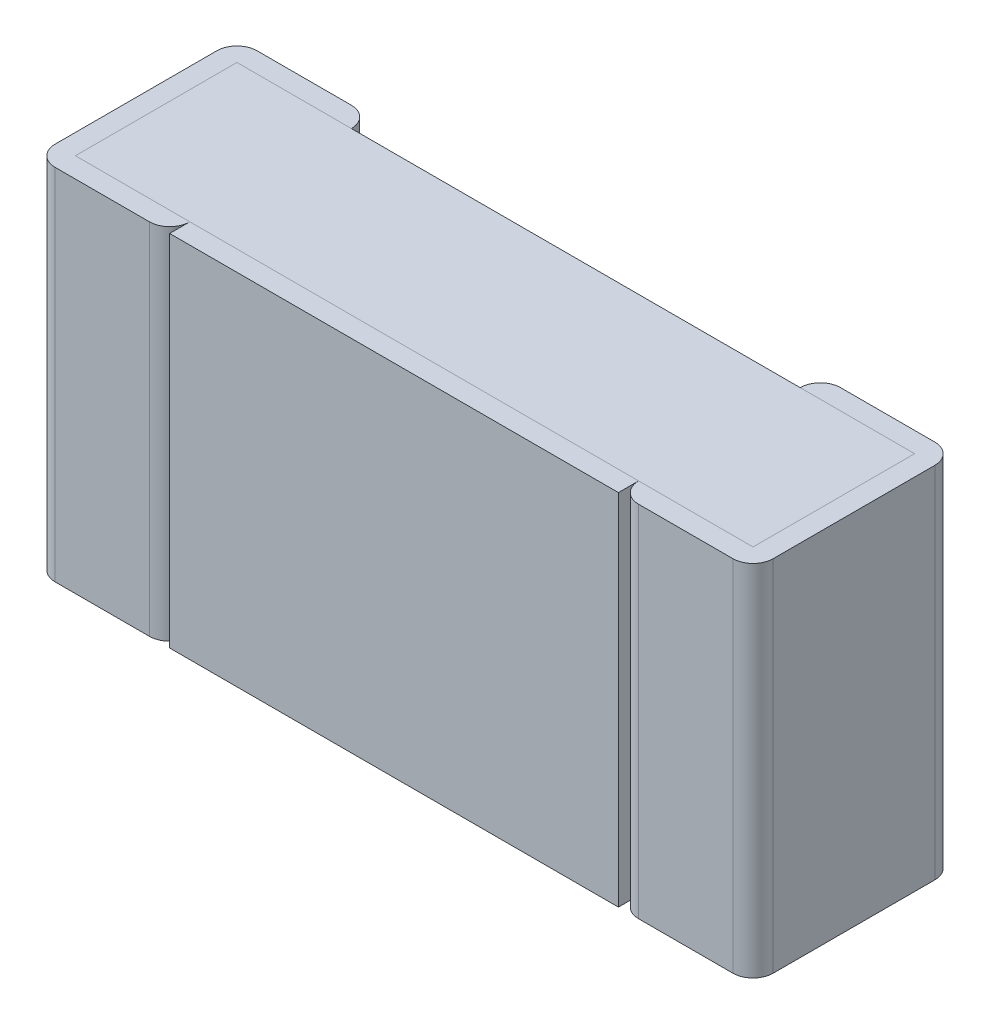
ISO-10303-21;
HEADER;
FILE_DESCRIPTION(('STEP AP214'),'2;1');
FILE_NAME('part.step','',(''),(''),'','','');
FILE_SCHEMA(('AUTOMOTIVE_DESIGN { 1 0 10303 214 1 1 1 1 }'));
ENDSEC;
DATA;
#1=APPLICATION_CONTEXT('core data for automotive mechanical design processes');
#2=APPLICATION_PROTOCOL_DEFINITION('international standard','automotive_design',2000,#1);
#3=PRODUCT_CONTEXT('',#1,'mechanical');
#4=PRODUCT('Part','Part','',(#3));
#5=PRODUCT_RELATED_PRODUCT_CATEGORY('part','',(#4));
#6=PRODUCT_DEFINITION_FORMATION('','',#4);
#7=PRODUCT_DEFINITION_CONTEXT('part definition',#1,'design');
#8=PRODUCT_DEFINITION('design','',#6,#7);
#9=PRODUCT_DEFINITION_SHAPE('','',#8);
#10=(LENGTH_UNIT() NAMED_UNIT(*) SI_UNIT(.MILLI.,.METRE.));
#11=(NAMED_UNIT(*) PLANE_ANGLE_UNIT() SI_UNIT($,.RADIAN.));
#12=(NAMED_UNIT(*) SI_UNIT($,.STERADIAN.) SOLID_ANGLE_UNIT());
#13=UNCERTAINTY_MEASURE_WITH_UNIT(LENGTH_MEASURE(1.E-05),#10,'distance_accuracy_value','');
#14=(GEOMETRIC_REPRESENTATION_CONTEXT(3) GLOBAL_UNCERTAINTY_ASSIGNED_CONTEXT((#13)) GLOBAL_UNIT_ASSIGNED_CONTEXT((#10,
#11,#12)) REPRESENTATION_CONTEXT('',''));
#15=CARTESIAN_POINT('',(0.,0.,0.));
#16=DIRECTION('',(0.,0.,1.));
#17=DIRECTION('',(1.,0.,0.));
#18=AXIS2_PLACEMENT_3D('',#15,#16,#17);
#19=CARTESIAN_POINT('',(-0.5,-0.4,0.45));
#20=DIRECTION('',(0.,0.,1.));
#21=DIRECTION('',(1.,0.,0.));
#22=AXIS2_PLACEMENT_3D('',#19,#20,#21);
#23=PLANE('',#22);
#24=DIRECTION('',(0.,1.,0.));
#25=VECTOR('',#24,1.);
#26=CARTESIAN_POINT('',(-0.5,-0.4,0.45));
#27=LINE('',#26,#25);
#28=CARTESIAN_POINT('',(-0.5,-0.4,0.45));
#29=VERTEX_POINT('',#28);
#30=CARTESIAN_POINT('',(-0.5,0.4,0.45));
#31=VERTEX_POINT('',#30);
#32=EDGE_CURVE('E144',#29,#31,#27,.T.);
#33=ORIENTED_EDGE('',*,*,#32,.F.);
#34=DIRECTION('',(1.,0.,0.));
#35=VECTOR('',#34,1.);
#36=CARTESIAN_POINT('',(-0.5,-0.4,0.45));
#37=LINE('',#36,#35);
#38=CARTESIAN_POINT('',(0.5,-0.4,0.45));
#39=VERTEX_POINT('',#38);
#40=EDGE_CURVE('E138',#29,#39,#37,.T.);
#41=ORIENTED_EDGE('',*,*,#40,.T.);
#42=DIRECTION('',(0.,1.,0.));
#43=VECTOR('',#42,1.);
#44=CARTESIAN_POINT('',(0.5,-0.4,0.45));
#45=LINE('',#44,#43);
#46=CARTESIAN_POINT('',(0.5,0.4,0.45));
#47=VERTEX_POINT('',#46);
#48=EDGE_CURVE('E11',#39,#47,#45,.T.);
#49=ORIENTED_EDGE('',*,*,#48,.T.);
#50=DIRECTION('',(1.,0.,0.));
#51=VECTOR('',#50,1.);
#52=CARTESIAN_POINT('',(-0.5,0.4,0.45));
#53=LINE('',#52,#51);
#54=EDGE_CURVE('E111',#31,#47,#53,.T.);
#55=ORIENTED_EDGE('',*,*,#54,.F.);
#56=EDGE_LOOP('',(#33,#41,#49,#55));
#57=FACE_BOUND('',#56,.T.);
#58=ADVANCED_FACE('F18',(#57),#23,.T.);
#59=CARTESIAN_POINT('',(0.5,-0.4,0.405));
#60=DIRECTION('',(1.,0.,0.));
#61=DIRECTION('',(0.,1.,0.));
#62=AXIS2_PLACEMENT_3D('',#59,#60,#61);
#63=PLANE('',#62);
#64=DIRECTION('',(0.,0.,1.));
#65=VECTOR('',#64,1.);
#66=CARTESIAN_POINT('',(0.5,-0.4,0.405));
#67=LINE('',#66,#65);
#68=CARTESIAN_POINT('',(0.5,-0.4,0.405));
#69=VERTEX_POINT('',#68);
#70=EDGE_CURVE('E136',#69,#39,#67,.T.);
#71=ORIENTED_EDGE('',*,*,#70,.F.);
#72=DIRECTION('',(0.,1.,0.));
#73=VECTOR('',#72,1.);
#74=CARTESIAN_POINT('',(0.5,-0.4,0.405));
#75=LINE('',#74,#73);
#76=CARTESIAN_POINT('',(0.5,0.4,0.405));
#77=VERTEX_POINT('',#76);
#78=EDGE_CURVE('E26',#69,#77,#75,.T.);
#79=ORIENTED_EDGE('',*,*,#78,.T.);
#80=DIRECTION('',(0.,0.,1.));
#81=VECTOR('',#80,1.);
#82=CARTESIAN_POINT('',(0.5,0.4,0.405));
#83=LINE('',#82,#81);
#84=EDGE_CURVE('E112',#77,#47,#83,.T.);
#85=ORIENTED_EDGE('',*,*,#84,.T.);
#86=ORIENTED_EDGE('',*,*,#48,.F.);
#87=EDGE_LOOP('',(#71,#79,#85,#86));
#88=FACE_BOUND('',#87,.T.);
#89=ADVANCED_FACE('F267',(#88),#63,.T.);
#90=CARTESIAN_POINT('',(0.545,-0.4,0.405));
#91=DIRECTION('',(0.,1.,0.));
#92=DIRECTION('',(-1.,0.,0.));
#93=AXIS2_PLACEMENT_3D('',#90,#91,#92);
#94=CYLINDRICAL_SURFACE('',#93,0.045);
#95=CARTESIAN_POINT('',(0.545,-0.4,0.405));
#96=DIRECTION('',(0.,1.,0.));
#97=DIRECTION('',(0.,0.,1.));
#98=AXIS2_PLACEMENT_3D('',#95,#96,#97);
#99=CIRCLE('',#98,0.045);
#100=CARTESIAN_POINT('',(0.545,-0.4,0.45));
#101=VERTEX_POINT('',#100);
#102=EDGE_CURVE('E245',#69,#101,#99,.T.);
#103=ORIENTED_EDGE('',*,*,#102,.T.);
#104=DIRECTION('',(0.,1.,0.));
#105=VECTOR('',#104,1.);
#106=CARTESIAN_POINT('',(0.545,-0.4,0.45));
#107=LINE('',#106,#105);
#108=CARTESIAN_POINT('',(0.545,0.4,0.45));
#109=VERTEX_POINT('',#108);
#110=EDGE_CURVE('E81',#101,#109,#107,.T.);
#111=ORIENTED_EDGE('',*,*,#110,.T.);
#112=CARTESIAN_POINT('',(0.545,0.4,0.405));
#113=DIRECTION('',(0.,1.,0.));
#114=DIRECTION('',(0.,0.,1.));
#115=AXIS2_PLACEMENT_3D('',#112,#113,#114);
#116=CIRCLE('',#115,0.045);
#117=EDGE_CURVE('E97',#77,#109,#116,.T.);
#118=ORIENTED_EDGE('',*,*,#117,.F.);
#119=ORIENTED_EDGE('',*,*,#78,.F.);
#120=EDGE_LOOP('',(#103,#111,#118,#119));
#121=FACE_BOUND('',#120,.T.);
#122=ADVANCED_FACE('F584',(#121),#94,.T.);
#123=CARTESIAN_POINT('',(0.5,-0.4,0.45));
#124=DIRECTION('',(0.,0.,1.));
#125=DIRECTION('',(1.,0.,0.));
#126=AXIS2_PLACEMENT_3D('',#123,#124,#125);
#127=PLANE('',#126);
#128=DIRECTION('',(1.,0.,0.));
#129=VECTOR('',#128,1.);
#130=CARTESIAN_POINT('',(0.5,0.4,0.45));
#131=LINE('',#130,#129);
#132=CARTESIAN_POINT('',(0.755,0.4,0.45));
#133=VERTEX_POINT('',#132);
#134=EDGE_CURVE('E72',#109,#133,#131,.T.);
#135=ORIENTED_EDGE('',*,*,#134,.F.);
#136=ORIENTED_EDGE('',*,*,#110,.F.);
#137=DIRECTION('',(1.,0.,0.));
#138=VECTOR('',#137,1.);
#139=CARTESIAN_POINT('',(0.5,-0.4,0.45));
#140=LINE('',#139,#138);
#141=CARTESIAN_POINT('',(0.755,-0.4,0.45));
#142=VERTEX_POINT('',#141);
#143=EDGE_CURVE('E76',#101,#142,#140,.T.);
#144=ORIENTED_EDGE('',*,*,#143,.T.);
#145=DIRECTION('',(0.,1.,0.));
#146=VECTOR('',#145,1.);
#147=CARTESIAN_POINT('',(0.755,-0.4,0.45));
#148=LINE('',#147,#146);
#149=EDGE_CURVE('E67',#142,#133,#148,.T.);
#150=ORIENTED_EDGE('',*,*,#149,.T.);
#151=EDGE_LOOP('',(#135,#136,#144,#150));
#152=FACE_BOUND('',#151,.T.);
#153=ADVANCED_FACE('F69',(#152),#127,.T.);
#154=CARTESIAN_POINT('',(0.755,-0.4,0.405));
#155=DIRECTION('',(0.,1.,0.));
#156=DIRECTION('',(1.,0.,0.));
#157=AXIS2_PLACEMENT_3D('',#154,#155,#156);
#158=CYLINDRICAL_SURFACE('',#157,0.045);
#159=DIRECTION('',(0.,1.,0.));
#160=VECTOR('',#159,1.);
#161=CARTESIAN_POINT('',(0.8,-0.4,0.405));
#162=LINE('',#161,#160);
#163=CARTESIAN_POINT('',(0.8,-0.4,0.405));
#164=VERTEX_POINT('',#163);
#165=CARTESIAN_POINT('',(0.8,0.4,0.405));
#166=VERTEX_POINT('',#165);
#167=EDGE_CURVE('E82',#164,#166,#162,.T.);
#168=ORIENTED_EDGE('',*,*,#167,.T.);
#169=CARTESIAN_POINT('',(0.755,0.4,0.405));
#170=DIRECTION('',(0.,-1.,0.));
#171=DIRECTION('',(0.,0.,1.));
#172=AXIS2_PLACEMENT_3D('',#169,#170,#171);
#173=CIRCLE('',#172,0.045);
#174=EDGE_CURVE('E85',#166,#133,#173,.T.);
#175=ORIENTED_EDGE('',*,*,#174,.T.);
#176=ORIENTED_EDGE('',*,*,#149,.F.);
#177=CARTESIAN_POINT('',(0.755,-0.4,0.405));
#178=DIRECTION('',(0.,-1.,0.));
#179=DIRECTION('',(0.,0.,1.));
#180=AXIS2_PLACEMENT_3D('',#177,#178,#179);
#181=CIRCLE('',#180,0.045);
#182=EDGE_CURVE('E237',#164,#142,#181,.T.);
#183=ORIENTED_EDGE('',*,*,#182,.F.);
#184=EDGE_LOOP('',(#168,#175,#176,#183));
#185=FACE_BOUND('',#184,.T.);
#186=ADVANCED_FACE('F86',(#185),#158,.T.);
#187=CARTESIAN_POINT('',(0.8,-0.4,0.));
#188=DIRECTION('',(1.,0.,0.));
#189=DIRECTION('',(0.,1.,0.));
#190=AXIS2_PLACEMENT_3D('',#187,#188,#189);
#191=PLANE('',#190);
#192=DIRECTION('',(0.,0.,1.));
#193=VECTOR('',#192,1.);
#194=CARTESIAN_POINT('',(0.8,-0.4,0.));
#195=LINE('',#194,#193);
#196=CARTESIAN_POINT('',(0.8,-0.4,0.045));
#197=VERTEX_POINT('',#196);
#198=EDGE_CURVE('E233',#197,#164,#195,.T.);
#199=ORIENTED_EDGE('',*,*,#198,.F.);
#200=DIRECTION('',(0.,1.,0.));
#201=VECTOR('',#200,1.);
#202=CARTESIAN_POINT('',(0.8,-0.4,0.045));
#203=LINE('',#202,#201);
#204=CARTESIAN_POINT('',(0.8,0.4,0.045));
#205=VERTEX_POINT('',#204);
#206=EDGE_CURVE('E49',#197,#205,#203,.T.);
#207=ORIENTED_EDGE('',*,*,#206,.T.);
#208=DIRECTION('',(0.,0.,1.));
#209=VECTOR('',#208,1.);
#210=CARTESIAN_POINT('',(0.8,0.4,0.));
#211=LINE('',#210,#209);
#212=EDGE_CURVE('E91',#205,#166,#211,.T.);
#213=ORIENTED_EDGE('',*,*,#212,.T.);
#214=ORIENTED_EDGE('',*,*,#167,.F.);
#215=EDGE_LOOP('',(#199,#207,#213,#214));
#216=FACE_BOUND('',#215,.T.);
#217=ADVANCED_FACE('F594',(#216),#191,.T.);
#218=CARTESIAN_POINT('',(0.755,-0.4,0.045));
#219=DIRECTION('',(0.,1.,0.));
#220=DIRECTION('',(1.,0.,0.));
#221=AXIS2_PLACEMENT_3D('',#218,#219,#220);
#222=CYLINDRICAL_SURFACE('',#221,0.045);
#223=CARTESIAN_POINT('',(0.755,-0.4,0.045));
#224=DIRECTION('',(0.,1.,0.));
#225=DIRECTION('',(0.,0.,1.));
#226=AXIS2_PLACEMENT_3D('',#223,#224,#225);
#227=CIRCLE('',#226,0.045);
#228=CARTESIAN_POINT('',(0.755,-0.4,0.));
#229=VERTEX_POINT('',#228);
#230=EDGE_CURVE('E183',#197,#229,#227,.T.);
#231=ORIENTED_EDGE('',*,*,#230,.T.);
#232=DIRECTION('',(0.,1.,0.));
#233=VECTOR('',#232,1.);
#234=CARTESIAN_POINT('',(0.755,-0.4,0.));
#235=LINE('',#234,#233);
#236=CARTESIAN_POINT('',(0.755,0.4,0.));
#237=VERTEX_POINT('',#236);
#238=EDGE_CURVE('E118',#229,#237,#235,.T.);
#239=ORIENTED_EDGE('',*,*,#238,.T.);
#240=CARTESIAN_POINT('',(0.755,0.4,0.045));
#241=DIRECTION('',(0.,1.,0.));
#242=DIRECTION('',(0.,0.,1.));
#243=AXIS2_PLACEMENT_3D('',#240,#241,#242);
#244=CIRCLE('',#243,0.045);
#245=EDGE_CURVE('E107',#205,#237,#244,.T.);
#246=ORIENTED_EDGE('',*,*,#245,.F.);
#247=ORIENTED_EDGE('',*,*,#206,.F.);
#248=EDGE_LOOP('',(#231,#239,#246,#247));
#249=FACE_BOUND('',#248,.T.);
#250=ADVANCED_FACE('F181',(#249),#222,.T.);
#251=CARTESIAN_POINT('',(0.5,-0.4,0.));
#252=DIRECTION('',(0.,0.,1.));
#253=DIRECTION('',(1.,0.,0.));
#254=AXIS2_PLACEMENT_3D('',#251,#252,#253);
#255=PLANE('',#254);
#256=ORIENTED_EDGE('',*,*,#238,.F.);
#257=DIRECTION('',(1.,0.,0.));
#258=VECTOR('',#257,1.);
#259=CARTESIAN_POINT('',(0.5,-0.4,0.));
#260=LINE('',#259,#258);
#261=CARTESIAN_POINT('',(0.545,-0.4,0.));
#262=VERTEX_POINT('',#261);
#263=EDGE_CURVE('E249',#262,#229,#260,.T.);
#264=ORIENTED_EDGE('',*,*,#263,.F.);
#265=DIRECTION('',(0.,1.,0.));
#266=VECTOR('',#265,1.);
#267=CARTESIAN_POINT('',(0.545,-0.4,0.));
#268=LINE('',#267,#266);
#269=CARTESIAN_POINT('',(0.545,0.4,0.));
#270=VERTEX_POINT('',#269);
#271=EDGE_CURVE('E115',#262,#270,#268,.T.);
#272=ORIENTED_EDGE('',*,*,#271,.T.);
#273=DIRECTION('',(1.,0.,0.));
#274=VECTOR('',#273,1.);
#275=CARTESIAN_POINT('',(0.5,0.4,0.));
#276=LINE('',#275,#274);
#277=EDGE_CURVE('E149',#270,#237,#276,.T.);
#278=ORIENTED_EDGE('',*,*,#277,.T.);
#279=EDGE_LOOP('',(#256,#264,#272,#278));
#280=FACE_BOUND('',#279,.T.);
#281=ADVANCED_FACE('F174',(#280),#255,.F.);
#282=CARTESIAN_POINT('',(0.545,-0.4,0.045));
#283=DIRECTION('',(0.,1.,0.));
#284=DIRECTION('',(-1.,0.,0.));
#285=AXIS2_PLACEMENT_3D('',#282,#283,#284);
#286=CYLINDRICAL_SURFACE('',#285,0.045);
#287=DIRECTION('',(0.,1.,0.));
#288=VECTOR('',#287,1.);
#289=CARTESIAN_POINT('',(0.5,-0.4,0.045));
#290=LINE('',#289,#288);
#291=CARTESIAN_POINT('',(0.5,-0.4,0.045));
#292=VERTEX_POINT('',#291);
#293=CARTESIAN_POINT('',(0.5,0.4,0.045));
#294=VERTEX_POINT('',#293);
#295=EDGE_CURVE('E167',#292,#294,#290,.T.);
#296=ORIENTED_EDGE('',*,*,#295,.T.);
#297=CARTESIAN_POINT('',(0.545,0.4,0.045));
#298=DIRECTION('',(0.,-1.,0.));
#299=DIRECTION('',(0.,0.,1.));
#300=AXIS2_PLACEMENT_3D('',#297,#298,#299);
#301=CIRCLE('',#300,0.045);
#302=EDGE_CURVE('E103',#294,#270,#301,.T.);
#303=ORIENTED_EDGE('',*,*,#302,.T.);
#304=ORIENTED_EDGE('',*,*,#271,.F.);
#305=CARTESIAN_POINT('',(0.545,-0.4,0.045));
#306=DIRECTION('',(0.,-1.,0.));
#307=DIRECTION('',(0.,0.,1.));
#308=AXIS2_PLACEMENT_3D('',#305,#306,#307);
#309=CIRCLE('',#308,0.045);
#310=EDGE_CURVE('E246',#292,#262,#309,.T.);
#311=ORIENTED_EDGE('',*,*,#310,.F.);
#312=EDGE_LOOP('',(#296,#303,#304,#311));
#313=FACE_BOUND('',#312,.T.);
#314=ADVANCED_FACE('F161',(#313),#286,.T.);
#315=CARTESIAN_POINT('',(-0.5,0.4,0.405));
#316=DIRECTION('',(0.,1.,0.));
#317=DIRECTION('',(1.,0.,0.));
#318=AXIS2_PLACEMENT_3D('',#315,#316,#317);
#319=PLANE('',#318);
#320=DIRECTION('',(1.,0.,0.));
#321=VECTOR('',#320,1.);
#322=CARTESIAN_POINT('',(-0.5,0.4,0.405));
#323=LINE('',#322,#321);
#324=CARTESIAN_POINT('',(-0.5,0.4,0.405));
#325=VERTEX_POINT('',#324);
#326=EDGE_CURVE('E216',#325,#77,#323,.T.);
#327=ORIENTED_EDGE('',*,*,#326,.F.);
#328=DIRECTION('',(0.,0.,1.));
#329=VECTOR('',#328,1.);
#330=CARTESIAN_POINT('',(-0.5,0.4,0.405));
#331=LINE('',#330,#329);
#332=EDGE_CURVE('E145',#325,#31,#331,.T.);
#333=ORIENTED_EDGE('',*,*,#332,.T.);
#334=ORIENTED_EDGE('',*,*,#54,.T.);
#335=ORIENTED_EDGE('',*,*,#84,.F.);
#336=EDGE_LOOP('',(#327,#333,#334,#335));
#337=FACE_BOUND('',#336,.T.);
#338=ADVANCED_FACE('F502',(#337),#319,.T.);
#339=CARTESIAN_POINT('',(0.5,0.4,0.));
#340=DIRECTION('',(0.,1.,0.));
#341=DIRECTION('',(1.,0.,0.));
#342=AXIS2_PLACEMENT_3D('',#339,#340,#341);
#343=PLANE('',#342);
#344=ORIENTED_EDGE('',*,*,#277,.F.);
#345=ORIENTED_EDGE('',*,*,#302,.F.);
#346=DIRECTION('',(1.,0.,0.));
#347=VECTOR('',#346,1.);
#348=CARTESIAN_POINT('',(-0.755,0.4,0.045));
#349=LINE('',#348,#347);
#350=CARTESIAN_POINT('',(0.755,0.4,0.045));
#351=VERTEX_POINT('',#350);
#352=EDGE_CURVE('E225',#294,#351,#349,.T.);
#353=ORIENTED_EDGE('',*,*,#352,.T.);
#354=DIRECTION('',(0.,0.,1.));
#355=VECTOR('',#354,1.);
#356=CARTESIAN_POINT('',(0.755,0.4,0.045));
#357=LINE('',#356,#355);
#358=CARTESIAN_POINT('',(0.755,0.4,0.405));
#359=VERTEX_POINT('',#358);
#360=EDGE_CURVE('E221',#351,#359,#357,.T.);
#361=ORIENTED_EDGE('',*,*,#360,.T.);
#362=DIRECTION('',(1.,0.,0.));
#363=VECTOR('',#362,1.);
#364=CARTESIAN_POINT('',(-0.755,0.4,0.405));
#365=LINE('',#364,#363);
#366=EDGE_CURVE('E217',#77,#359,#365,.T.);
#367=ORIENTED_EDGE('',*,*,#366,.F.);
#368=ORIENTED_EDGE('',*,*,#117,.T.);
#369=ORIENTED_EDGE('',*,*,#134,.T.);
#370=ORIENTED_EDGE('',*,*,#174,.F.);
#371=ORIENTED_EDGE('',*,*,#212,.F.);
#372=ORIENTED_EDGE('',*,*,#245,.T.);
#373=EDGE_LOOP('',(#344,#345,#353,#361,#367,#368,#369,#370,#371,#372));
#374=FACE_BOUND('',#373,.T.);
#375=ADVANCED_FACE('F94',(#374),#343,.T.);
#376=CARTESIAN_POINT('',(-0.5,-0.4,0.405));
#377=DIRECTION('',(1.,0.,0.));
#378=DIRECTION('',(0.,1.,0.));
#379=AXIS2_PLACEMENT_3D('',#376,#377,#378);
#380=PLANE('',#379);
#381=ORIENTED_EDGE('',*,*,#32,.T.);
#382=ORIENTED_EDGE('',*,*,#332,.F.);
#383=DIRECTION('',(0.,1.,0.));
#384=VECTOR('',#383,1.);
#385=CARTESIAN_POINT('',(-0.5,-0.4,0.405));
#386=LINE('',#385,#384);
#387=CARTESIAN_POINT('',(-0.5,-0.4,0.405));
#388=VERTEX_POINT('',#387);
#389=EDGE_CURVE('E212',#388,#325,#386,.T.);
#390=ORIENTED_EDGE('',*,*,#389,.F.);
#391=DIRECTION('',(0.,0.,1.));
#392=VECTOR('',#391,1.);
#393=CARTESIAN_POINT('',(-0.5,-0.4,0.405));
#394=LINE('',#393,#392);
#395=EDGE_CURVE('E140',#388,#29,#394,.T.);
#396=ORIENTED_EDGE('',*,*,#395,.T.);
#397=EDGE_LOOP('',(#381,#382,#390,#396));
#398=FACE_BOUND('',#397,.T.);
#399=ADVANCED_FACE('F506',(#398),#380,.F.);
#400=CARTESIAN_POINT('',(-0.5,-0.4,0.405));
#401=DIRECTION('',(0.,1.,0.));
#402=DIRECTION('',(1.,0.,0.));
#403=AXIS2_PLACEMENT_3D('',#400,#401,#402);
#404=PLANE('',#403);
#405=ORIENTED_EDGE('',*,*,#70,.T.);
#406=ORIENTED_EDGE('',*,*,#40,.F.);
#407=ORIENTED_EDGE('',*,*,#395,.F.);
#408=DIRECTION('',(1.,0.,0.));
#409=VECTOR('',#408,1.);
#410=CARTESIAN_POINT('',(-0.5,-0.4,0.405));
#411=LINE('',#410,#409);
#412=EDGE_CURVE('E207',#388,#69,#411,.T.);
#413=ORIENTED_EDGE('',*,*,#412,.T.);
#414=EDGE_LOOP('',(#405,#406,#407,#413));
#415=FACE_BOUND('',#414,.T.);
#416=ADVANCED_FACE('F258',(#415),#404,.F.);
#417=CARTESIAN_POINT('',(0.5,-0.4,0.));
#418=DIRECTION('',(0.,1.,0.));
#419=DIRECTION('',(1.,0.,0.));
#420=AXIS2_PLACEMENT_3D('',#417,#418,#419);
#421=PLANE('',#420);
#422=ORIENTED_EDGE('',*,*,#230,.F.);
#423=ORIENTED_EDGE('',*,*,#198,.T.);
#424=ORIENTED_EDGE('',*,*,#182,.T.);
#425=ORIENTED_EDGE('',*,*,#143,.F.);
#426=ORIENTED_EDGE('',*,*,#102,.F.);
#427=DIRECTION('',(1.,0.,0.));
#428=VECTOR('',#427,1.);
#429=CARTESIAN_POINT('',(-0.755,-0.4,0.405));
#430=LINE('',#429,#428);
#431=CARTESIAN_POINT('',(0.755,-0.4,0.405));
#432=VERTEX_POINT('',#431);
#433=EDGE_CURVE('E203',#69,#432,#430,.T.);
#434=ORIENTED_EDGE('',*,*,#433,.T.);
#435=DIRECTION('',(0.,0.,1.));
#436=VECTOR('',#435,1.);
#437=CARTESIAN_POINT('',(0.755,-0.4,0.045));
#438=LINE('',#437,#436);
#439=CARTESIAN_POINT('',(0.755,-0.4,0.045));
#440=VERTEX_POINT('',#439);
#441=EDGE_CURVE('E202',#440,#432,#438,.T.);
#442=ORIENTED_EDGE('',*,*,#441,.F.);
#443=DIRECTION('',(1.,0.,0.));
#444=VECTOR('',#443,1.);
#445=CARTESIAN_POINT('',(-0.755,-0.4,0.045));
#446=LINE('',#445,#444);
#447=EDGE_CURVE('E198',#292,#440,#446,.T.);
#448=ORIENTED_EDGE('',*,*,#447,.F.);
#449=ORIENTED_EDGE('',*,*,#310,.T.);
#450=ORIENTED_EDGE('',*,*,#263,.T.);
#451=EDGE_LOOP('',(#422,#423,#424,#425,#426,#434,#442,#448,#449,#450));
#452=FACE_BOUND('',#451,.T.);
#453=ADVANCED_FACE('F271',(#452),#421,.F.);
#454=CARTESIAN_POINT('',(-0.755,-0.4,0.045));
#455=DIRECTION('',(0.,0.,1.));
#456=DIRECTION('',(1.,0.,0.));
#457=AXIS2_PLACEMENT_3D('',#454,#455,#456);
#458=PLANE('',#457);
#459=DIRECTION('',(1.,0.,0.));
#460=VECTOR('',#459,1.);
#461=CARTESIAN_POINT('',(-0.755,0.4,0.045));
#462=LINE('',#461,#460);
#463=CARTESIAN_POINT('',(-0.5,0.4,0.045));
#464=VERTEX_POINT('',#463);
#465=EDGE_CURVE('E228',#464,#294,#462,.T.);
#466=ORIENTED_EDGE('',*,*,#465,.T.);
#467=ORIENTED_EDGE('',*,*,#295,.F.);
#468=DIRECTION('',(1.,0.,0.));
#469=VECTOR('',#468,1.);
#470=CARTESIAN_POINT('',(-0.755,-0.4,0.045));
#471=LINE('',#470,#469);
#472=CARTESIAN_POINT('',(-0.5,-0.4,0.045));
#473=VERTEX_POINT('',#472);
#474=EDGE_CURVE('E195',#473,#292,#471,.T.);
#475=ORIENTED_EDGE('',*,*,#474,.F.);
#476=DIRECTION('',(0.,1.,0.));
#477=VECTOR('',#476,1.);
#478=CARTESIAN_POINT('',(-0.5,-0.4,0.045));
#479=LINE('',#478,#477);
#480=EDGE_CURVE('E193',#473,#464,#479,.T.);
#481=ORIENTED_EDGE('',*,*,#480,.T.);
#482=EDGE_LOOP('',(#466,#467,#475,#481));
#483=FACE_BOUND('',#482,.T.);
#484=ADVANCED_FACE('F568',(#483),#458,.F.);
#485=CARTESIAN_POINT('',(-0.755,0.4,0.045));
#486=DIRECTION('',(0.,1.,0.));
#487=DIRECTION('',(1.,0.,0.));
#488=AXIS2_PLACEMENT_3D('',#485,#486,#487);
#489=PLANE('',#488);
#490=DIRECTION('',(1.,0.,0.));
#491=VECTOR('',#490,1.);
#492=CARTESIAN_POINT('',(-0.755,0.4,0.045));
#493=LINE('',#492,#491);
#494=CARTESIAN_POINT('',(-0.755,0.4,0.045));
#495=VERTEX_POINT('',#494);
#496=EDGE_CURVE('E343',#495,#464,#493,.T.);
#497=ORIENTED_EDGE('',*,*,#496,.F.);
#498=DIRECTION('',(0.,0.,1.));
#499=VECTOR('',#498,1.);
#500=CARTESIAN_POINT('',(-0.755,0.4,0.045));
#501=LINE('',#500,#499);
#502=CARTESIAN_POINT('',(-0.755,0.4,0.405));
#503=VERTEX_POINT('',#502);
#504=EDGE_CURVE('E308',#495,#503,#501,.T.);
#505=ORIENTED_EDGE('',*,*,#504,.T.);
#506=DIRECTION('',(1.,0.,0.));
#507=VECTOR('',#506,1.);
#508=CARTESIAN_POINT('',(-0.755,0.4,0.405));
#509=LINE('',#508,#507);
#510=EDGE_CURVE('E304',#503,#325,#509,.T.);
#511=ORIENTED_EDGE('',*,*,#510,.T.);
#512=ORIENTED_EDGE('',*,*,#326,.T.);
#513=ORIENTED_EDGE('',*,*,#366,.T.);
#514=ORIENTED_EDGE('',*,*,#360,.F.);
#515=ORIENTED_EDGE('',*,*,#352,.F.);
#516=ORIENTED_EDGE('',*,*,#465,.F.);
#517=EDGE_LOOP('',(#497,#505,#511,#512,#513,#514,#515,#516));
#518=FACE_BOUND('',#517,.T.);
#519=ADVANCED_FACE('F564',(#518),#489,.T.);
#520=CARTESIAN_POINT('',(-0.545,-0.4,0.405));
#521=DIRECTION('',(0.,1.,0.));
#522=DIRECTION('',(1.,0.,0.));
#523=AXIS2_PLACEMENT_3D('',#520,#521,#522);
#524=CYLINDRICAL_SURFACE('',#523,0.045);
#525=ORIENTED_EDGE('',*,*,#389,.T.);
#526=CARTESIAN_POINT('',(-0.545,0.4,0.405));
#527=DIRECTION('',(0.,-1.,0.));
#528=DIRECTION('',(0.,0.,1.));
#529=AXIS2_PLACEMENT_3D('',#526,#527,#528);
#530=CIRCLE('',#529,0.045);
#531=CARTESIAN_POINT('',(-0.545,0.4,0.45));
#532=VERTEX_POINT('',#531);
#533=EDGE_CURVE('E309',#325,#532,#530,.T.);
#534=ORIENTED_EDGE('',*,*,#533,.T.);
#535=DIRECTION('',(0.,1.,0.));
#536=VECTOR('',#535,1.);
#537=CARTESIAN_POINT('',(-0.545,-0.4,0.45));
#538=LINE('',#537,#536);
#539=CARTESIAN_POINT('',(-0.545,-0.4,0.45));
#540=VERTEX_POINT('',#539);
#541=EDGE_CURVE('E211',#540,#532,#538,.T.);
#542=ORIENTED_EDGE('',*,*,#541,.F.);
#543=CARTESIAN_POINT('',(-0.545,-0.4,0.405));
#544=DIRECTION('',(0.,-1.,0.));
#545=DIRECTION('',(0.,0.,1.));
#546=AXIS2_PLACEMENT_3D('',#543,#544,#545);
#547=CIRCLE('',#546,0.045);
#548=EDGE_CURVE('E291',#388,#540,#547,.T.);
#549=ORIENTED_EDGE('',*,*,#548,.F.);
#550=EDGE_LOOP('',(#525,#534,#542,#549));
#551=FACE_BOUND('',#550,.T.);
#552=ADVANCED_FACE('F511',(#551),#524,.T.);
#553=CARTESIAN_POINT('',(-0.8,-0.4,0.45));
#554=DIRECTION('',(0.,0.,1.));
#555=DIRECTION('',(1.,0.,0.));
#556=AXIS2_PLACEMENT_3D('',#553,#554,#555);
#557=PLANE('',#556);
#558=DIRECTION('',(1.,0.,0.));
#559=VECTOR('',#558,1.);
#560=CARTESIAN_POINT('',(-0.8,0.4,0.45));
#561=LINE('',#560,#559);
#562=CARTESIAN_POINT('',(-0.755,0.4,0.45));
#563=VERTEX_POINT('',#562);
#564=EDGE_CURVE('E327',#563,#532,#561,.T.);
#565=ORIENTED_EDGE('',*,*,#564,.F.);
#566=DIRECTION('',(0.,1.,0.));
#567=VECTOR('',#566,1.);
#568=CARTESIAN_POINT('',(-0.755,-0.4,0.45));
#569=LINE('',#568,#567);
#570=CARTESIAN_POINT('',(-0.755,-0.4,0.45));
#571=VERTEX_POINT('',#570);
#572=EDGE_CURVE('E317',#571,#563,#569,.T.);
#573=ORIENTED_EDGE('',*,*,#572,.F.);
#574=DIRECTION('',(1.,0.,0.));
#575=VECTOR('',#574,1.);
#576=CARTESIAN_POINT('',(-0.8,-0.4,0.45));
#577=LINE('',#576,#575);
#578=EDGE_CURVE('E295',#571,#540,#577,.T.);
#579=ORIENTED_EDGE('',*,*,#578,.T.);
#580=ORIENTED_EDGE('',*,*,#541,.T.);
#581=EDGE_LOOP('',(#565,#573,#579,#580));
#582=FACE_BOUND('',#581,.T.);
#583=ADVANCED_FACE('F418',(#582),#557,.T.);
#584=CARTESIAN_POINT('',(-0.755,-0.4,0.045));
#585=DIRECTION('',(0.,1.,0.));
#586=DIRECTION('',(1.,0.,0.));
#587=AXIS2_PLACEMENT_3D('',#584,#585,#586);
#588=PLANE('',#587);
#589=ORIENTED_EDGE('',*,*,#474,.T.);
#590=ORIENTED_EDGE('',*,*,#447,.T.);
#591=ORIENTED_EDGE('',*,*,#441,.T.);
#592=ORIENTED_EDGE('',*,*,#433,.F.);
#593=ORIENTED_EDGE('',*,*,#412,.F.);
#594=DIRECTION('',(1.,0.,0.));
#595=VECTOR('',#594,1.);
#596=CARTESIAN_POINT('',(-0.755,-0.4,0.405));
#597=LINE('',#596,#595);
#598=CARTESIAN_POINT('',(-0.755,-0.4,0.405));
#599=VERTEX_POINT('',#598);
#600=EDGE_CURVE('E287',#599,#388,#597,.T.);
#601=ORIENTED_EDGE('',*,*,#600,.F.);
#602=DIRECTION('',(0.,0.,1.));
#603=VECTOR('',#602,1.);
#604=CARTESIAN_POINT('',(-0.755,-0.4,0.045));
#605=LINE('',#604,#603);
#606=CARTESIAN_POINT('',(-0.755,-0.4,0.045));
#607=VERTEX_POINT('',#606);
#608=EDGE_CURVE('E284',#607,#599,#605,.T.);
#609=ORIENTED_EDGE('',*,*,#608,.F.);
#610=DIRECTION('',(1.,0.,0.));
#611=VECTOR('',#610,1.);
#612=CARTESIAN_POINT('',(-0.755,-0.4,0.045));
#613=LINE('',#612,#611);
#614=EDGE_CURVE('E282',#607,#473,#613,.T.);
#615=ORIENTED_EDGE('',*,*,#614,.T.);
#616=EDGE_LOOP('',(#589,#590,#591,#592,#593,#601,#609,#615));
#617=FACE_BOUND('',#616,.T.);
#618=ADVANCED_FACE('F510',(#617),#588,.F.);
#619=CARTESIAN_POINT('',(-0.545,-0.4,0.045));
#620=DIRECTION('',(0.,1.,0.));
#621=DIRECTION('',(1.,0.,0.));
#622=AXIS2_PLACEMENT_3D('',#619,#620,#621);
#623=CYLINDRICAL_SURFACE('',#622,0.045);
#624=CARTESIAN_POINT('',(-0.545,-0.4,0.045));
#625=DIRECTION('',(0.,1.,0.));
#626=DIRECTION('',(0.,0.,1.));
#627=AXIS2_PLACEMENT_3D('',#624,#625,#626);
#628=CIRCLE('',#627,0.045);
#629=CARTESIAN_POINT('',(-0.545,-0.4,0.));
#630=VERTEX_POINT('',#629);
#631=EDGE_CURVE('E368',#473,#630,#628,.T.);
#632=ORIENTED_EDGE('',*,*,#631,.T.);
#633=DIRECTION('',(0.,1.,0.));
#634=VECTOR('',#633,1.);
#635=CARTESIAN_POINT('',(-0.545,-0.4,0.));
#636=LINE('',#635,#634);
#637=CARTESIAN_POINT('',(-0.545,0.4,0.));
#638=VERTEX_POINT('',#637);
#639=EDGE_CURVE('E347',#630,#638,#636,.T.);
#640=ORIENTED_EDGE('',*,*,#639,.T.);
#641=CARTESIAN_POINT('',(-0.545,0.4,0.045));
#642=DIRECTION('',(0.,1.,0.));
#643=DIRECTION('',(0.,0.,1.));
#644=AXIS2_PLACEMENT_3D('',#641,#642,#643);
#645=CIRCLE('',#644,0.045);
#646=EDGE_CURVE('E346',#464,#638,#645,.T.);
#647=ORIENTED_EDGE('',*,*,#646,.F.);
#648=ORIENTED_EDGE('',*,*,#480,.F.);
#649=EDGE_LOOP('',(#632,#640,#647,#648));
#650=FACE_BOUND('',#649,.T.);
#651=ADVANCED_FACE('F569',(#650),#623,.T.);
#652=CARTESIAN_POINT('',(-0.8,-0.4,0.));
#653=DIRECTION('',(0.,0.,1.));
#654=DIRECTION('',(1.,0.,0.));
#655=AXIS2_PLACEMENT_3D('',#652,#653,#654);
#656=PLANE('',#655);
#657=ORIENTED_EDGE('',*,*,#639,.F.);
#658=DIRECTION('',(1.,0.,0.));
#659=VECTOR('',#658,1.);
#660=CARTESIAN_POINT('',(-0.8,-0.4,0.));
#661=LINE('',#660,#659);
#662=CARTESIAN_POINT('',(-0.755,-0.4,0.));
#663=VERTEX_POINT('',#662);
#664=EDGE_CURVE('E300',#663,#630,#661,.T.);
#665=ORIENTED_EDGE('',*,*,#664,.F.);
#666=DIRECTION('',(0.,1.,0.));
#667=VECTOR('',#666,1.);
#668=CARTESIAN_POINT('',(-0.755,-0.4,0.));
#669=LINE('',#668,#667);
#670=CARTESIAN_POINT('',(-0.755,0.4,0.));
#671=VERTEX_POINT('',#670);
#672=EDGE_CURVE('E313',#663,#671,#669,.T.);
#673=ORIENTED_EDGE('',*,*,#672,.T.);
#674=DIRECTION('',(1.,0.,0.));
#675=VECTOR('',#674,1.);
#676=CARTESIAN_POINT('',(-0.8,0.4,0.));
#677=LINE('',#676,#675);
#678=EDGE_CURVE('E323',#671,#638,#677,.T.);
#679=ORIENTED_EDGE('',*,*,#678,.T.);
#680=EDGE_LOOP('',(#657,#665,#673,#679));
#681=FACE_BOUND('',#680,.T.);
#682=ADVANCED_FACE('F558',(#681),#656,.F.);
#683=CARTESIAN_POINT('',(-0.8,0.4,0.));
#684=DIRECTION('',(0.,1.,0.));
#685=DIRECTION('',(1.,0.,0.));
#686=AXIS2_PLACEMENT_3D('',#683,#684,#685);
#687=PLANE('',#686);
#688=ORIENTED_EDGE('',*,*,#678,.F.);
#689=CARTESIAN_POINT('',(-0.755,0.4,0.045));
#690=DIRECTION('',(0.,-1.,0.));
#691=DIRECTION('',(0.,0.,1.));
#692=AXIS2_PLACEMENT_3D('',#689,#690,#691);
#693=CIRCLE('',#692,0.045);
#694=CARTESIAN_POINT('',(-0.8,0.4,0.045));
#695=VERTEX_POINT('',#694);
#696=EDGE_CURVE('E318',#695,#671,#693,.T.);
#697=ORIENTED_EDGE('',*,*,#696,.F.);
#698=DIRECTION('',(0.,0.,1.));
#699=VECTOR('',#698,1.);
#700=CARTESIAN_POINT('',(-0.8,0.4,0.));
#701=LINE('',#700,#699);
#702=CARTESIAN_POINT('',(-0.8,0.4,0.405));
#703=VERTEX_POINT('',#702);
#704=EDGE_CURVE('E386',#695,#703,#701,.T.);
#705=ORIENTED_EDGE('',*,*,#704,.T.);
#706=CARTESIAN_POINT('',(-0.755,0.4,0.405));
#707=DIRECTION('',(0.,1.,0.));
#708=DIRECTION('',(0.,0.,1.));
#709=AXIS2_PLACEMENT_3D('',#706,#707,#708);
#710=CIRCLE('',#709,0.045);
#711=EDGE_CURVE('E319',#703,#563,#710,.T.);
#712=ORIENTED_EDGE('',*,*,#711,.T.);
#713=ORIENTED_EDGE('',*,*,#564,.T.);
#714=ORIENTED_EDGE('',*,*,#533,.F.);
#715=ORIENTED_EDGE('',*,*,#510,.F.);
#716=ORIENTED_EDGE('',*,*,#504,.F.);
#717=ORIENTED_EDGE('',*,*,#496,.T.);
#718=ORIENTED_EDGE('',*,*,#646,.T.);
#719=EDGE_LOOP('',(#688,#697,#705,#712,#713,#714,#715,#716,#717,#718));
#720=FACE_BOUND('',#719,.T.);
#721=ADVANCED_FACE('F559',(#720),#687,.T.);
#722=CARTESIAN_POINT('',(-0.755,-0.4,0.405));
#723=DIRECTION('',(0.,1.,0.));
#724=DIRECTION('',(-1.,0.,0.));
#725=AXIS2_PLACEMENT_3D('',#722,#723,#724);
#726=CYLINDRICAL_SURFACE('',#725,0.045);
#727=CARTESIAN_POINT('',(-0.755,-0.4,0.405));
#728=DIRECTION('',(0.,1.,0.));
#729=DIRECTION('',(0.,0.,1.));
#730=AXIS2_PLACEMENT_3D('',#727,#728,#729);
#731=CIRCLE('',#730,0.045);
#732=CARTESIAN_POINT('',(-0.8,-0.4,0.405));
#733=VERTEX_POINT('',#732);
#734=EDGE_CURVE('E301',#733,#571,#731,.T.);
#735=ORIENTED_EDGE('',*,*,#734,.T.);
#736=ORIENTED_EDGE('',*,*,#572,.T.);
#737=ORIENTED_EDGE('',*,*,#711,.F.);
#738=DIRECTION('',(0.,1.,0.));
#739=VECTOR('',#738,1.);
#740=CARTESIAN_POINT('',(-0.8,-0.4,0.405));
#741=LINE('',#740,#739);
#742=EDGE_CURVE('E397',#733,#703,#741,.T.);
#743=ORIENTED_EDGE('',*,*,#742,.F.);
#744=EDGE_LOOP('',(#735,#736,#737,#743));
#745=FACE_BOUND('',#744,.T.);
#746=ADVANCED_FACE('F407',(#745),#726,.T.);
#747=CARTESIAN_POINT('',(-0.755,-0.4,0.045));
#748=DIRECTION('',(0.,1.,0.));
#749=DIRECTION('',(-1.,0.,0.));
#750=AXIS2_PLACEMENT_3D('',#747,#748,#749);
#751=CYLINDRICAL_SURFACE('',#750,0.045);
#752=DIRECTION('',(0.,1.,0.));
#753=VECTOR('',#752,1.);
#754=CARTESIAN_POINT('',(-0.8,-0.4,0.045));
#755=LINE('',#754,#753);
#756=CARTESIAN_POINT('',(-0.8,-0.4,0.045));
#757=VERTEX_POINT('',#756);
#758=EDGE_CURVE('E375',#757,#695,#755,.T.);
#759=ORIENTED_EDGE('',*,*,#758,.T.);
#760=ORIENTED_EDGE('',*,*,#696,.T.);
#761=ORIENTED_EDGE('',*,*,#672,.F.);
#762=CARTESIAN_POINT('',(-0.755,-0.4,0.045));
#763=DIRECTION('',(0.,-1.,0.));
#764=DIRECTION('',(0.,0.,1.));
#765=AXIS2_PLACEMENT_3D('',#762,#763,#764);
#766=CIRCLE('',#765,0.045);
#767=EDGE_CURVE('E296',#757,#663,#766,.T.);
#768=ORIENTED_EDGE('',*,*,#767,.F.);
#769=EDGE_LOOP('',(#759,#760,#761,#768));
#770=FACE_BOUND('',#769,.T.);
#771=ADVANCED_FACE('F557',(#770),#751,.T.);
#772=CARTESIAN_POINT('',(-0.8,-0.4,0.));
#773=DIRECTION('',(0.,1.,0.));
#774=DIRECTION('',(1.,0.,0.));
#775=AXIS2_PLACEMENT_3D('',#772,#773,#774);
#776=PLANE('',#775);
#777=ORIENTED_EDGE('',*,*,#631,.F.);
#778=ORIENTED_EDGE('',*,*,#614,.F.);
#779=ORIENTED_EDGE('',*,*,#608,.T.);
#780=ORIENTED_EDGE('',*,*,#600,.T.);
#781=ORIENTED_EDGE('',*,*,#548,.T.);
#782=ORIENTED_EDGE('',*,*,#578,.F.);
#783=ORIENTED_EDGE('',*,*,#734,.F.);
#784=DIRECTION('',(0.,0.,1.));
#785=VECTOR('',#784,1.);
#786=CARTESIAN_POINT('',(-0.8,-0.4,0.));
#787=LINE('',#786,#785);
#788=EDGE_CURVE('E366',#757,#733,#787,.T.);
#789=ORIENTED_EDGE('',*,*,#788,.F.);
#790=ORIENTED_EDGE('',*,*,#767,.T.);
#791=ORIENTED_EDGE('',*,*,#664,.T.);
#792=EDGE_LOOP('',(#777,#778,#779,#780,#781,#782,#783,#789,#790,#791));
#793=FACE_BOUND('',#792,.T.);
#794=ADVANCED_FACE('F513',(#793),#776,.F.);
#795=CARTESIAN_POINT('',(-0.8,-0.4,0.));
#796=DIRECTION('',(1.,0.,0.));
#797=DIRECTION('',(0.,1.,0.));
#798=AXIS2_PLACEMENT_3D('',#795,#796,#797);
#799=PLANE('',#798);
#800=ORIENTED_EDGE('',*,*,#742,.T.);
#801=ORIENTED_EDGE('',*,*,#704,.F.);
#802=ORIENTED_EDGE('',*,*,#758,.F.);
#803=ORIENTED_EDGE('',*,*,#788,.T.);
#804=EDGE_LOOP('',(#800,#801,#802,#803));
#805=FACE_BOUND('',#804,.T.);
#806=ADVANCED_FACE('F537',(#805),#799,.F.);
#807=CLOSED_SHELL('',(#58,#89,#122,#153,#186,#217,#250,#281,#314,#338,#375,#399,#416,#453,#484,
#519,#552,#583,#618,#651,#682,#721,#746,#771,#794,#806));
#808=MANIFOLD_SOLID_BREP('B1',#807);
#809=ADVANCED_BREP_SHAPE_REPRESENTATION('',(#18,#808),#14);
#810=SHAPE_DEFINITION_REPRESENTATION(#9,#809);
ENDSEC;
END-ISO-10303-21;
